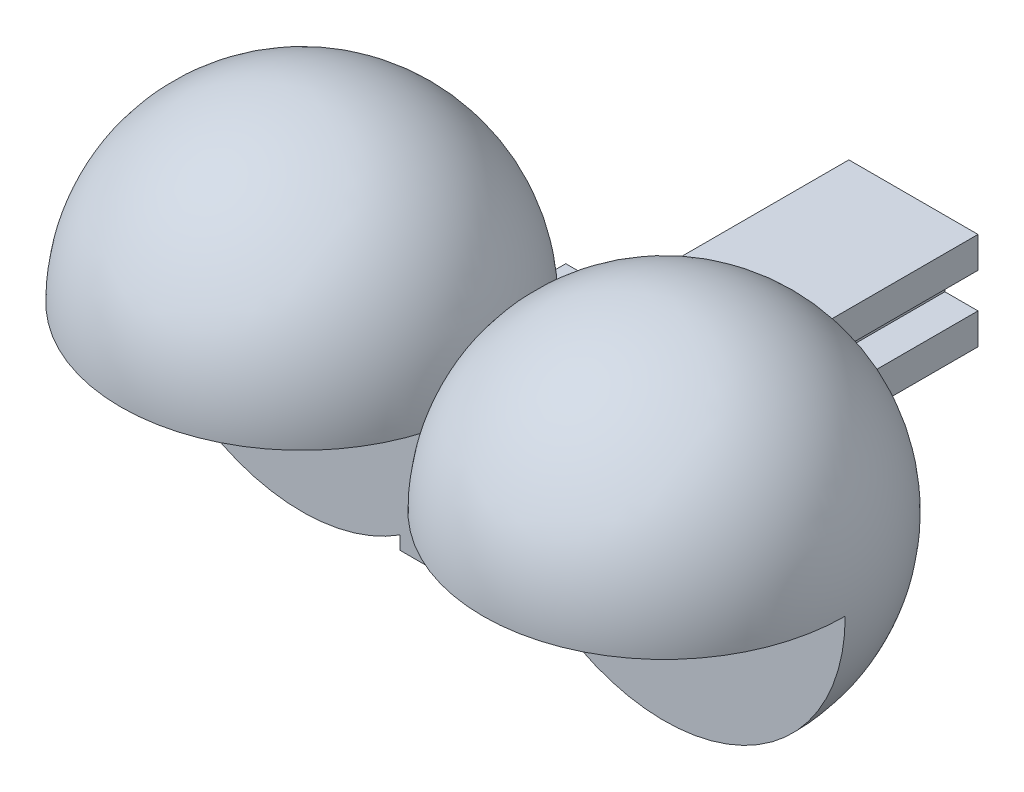
ISO-10303-21;
HEADER;
FILE_DESCRIPTION(('STEP AP214'),'2;1');
FILE_NAME('part.step','',(''),(''),'','','');
FILE_SCHEMA(('AUTOMOTIVE_DESIGN { 1 0 10303 214 1 1 1 1 }'));
ENDSEC;
DATA;
#1=APPLICATION_CONTEXT('core data for automotive mechanical design processes');
#2=APPLICATION_PROTOCOL_DEFINITION('international standard','automotive_design',2000,#1);
#3=PRODUCT_CONTEXT('',#1,'mechanical');
#4=PRODUCT('Part','Part','',(#3));
#5=PRODUCT_RELATED_PRODUCT_CATEGORY('part','',(#4));
#6=PRODUCT_DEFINITION_FORMATION('','',#4);
#7=PRODUCT_DEFINITION_CONTEXT('part definition',#1,'design');
#8=PRODUCT_DEFINITION('design','',#6,#7);
#9=PRODUCT_DEFINITION_SHAPE('','',#8);
#10=(LENGTH_UNIT() NAMED_UNIT(*) SI_UNIT(.MILLI.,.METRE.));
#11=(NAMED_UNIT(*) PLANE_ANGLE_UNIT() SI_UNIT($,.RADIAN.));
#12=(NAMED_UNIT(*) SI_UNIT($,.STERADIAN.) SOLID_ANGLE_UNIT());
#13=UNCERTAINTY_MEASURE_WITH_UNIT(LENGTH_MEASURE(1.E-05),#10,'distance_accuracy_value','');
#14=(GEOMETRIC_REPRESENTATION_CONTEXT(3) GLOBAL_UNCERTAINTY_ASSIGNED_CONTEXT((#13)) GLOBAL_UNIT_ASSIGNED_CONTEXT((#10,
#11,#12)) REPRESENTATION_CONTEXT('',''));
#15=CARTESIAN_POINT('',(0.,0.,0.));
#16=DIRECTION('',(0.,0.,1.));
#17=DIRECTION('',(1.,0.,0.));
#18=AXIS2_PLACEMENT_3D('',#15,#16,#17);
#19=CARTESIAN_POINT('',(-58.0027176246546,-27.35,0.));
#20=DIRECTION('',(0.,0.,-1.));
#21=DIRECTION('',(-1.,0.,0.));
#22=AXIS2_PLACEMENT_3D('',#19,#20,#21);
#23=PLANE('',#22);
#24=DIRECTION('',(0.,-1.,0.));
#25=VECTOR('',#24,1.);
#26=CARTESIAN_POINT('',(12.5,0.,0.));
#27=LINE('',#26,#25);
#28=CARTESIAN_POINT('',(12.5,-22.9673681557117,0.));
#29=VERTEX_POINT('',#28);
#30=CARTESIAN_POINT('',(12.5,-25.,0.));
#31=VERTEX_POINT('',#30);
#32=EDGE_CURVE('E426',#29,#31,#27,.T.);
#33=ORIENTED_EDGE('',*,*,#32,.F.);
#34=CARTESIAN_POINT('',(27.35,0.,0.));
#35=DIRECTION('',(0.,0.,-1.));
#36=DIRECTION('',(-1.,0.,0.));
#37=AXIS2_PLACEMENT_3D('',#34,#35,#36);
#38=CIRCLE('',#37,27.35);
#39=CARTESIAN_POINT('',(54.7,0.,0.));
#40=VERTEX_POINT('',#39);
#41=EDGE_CURVE('E412',#29,#40,#38,.F.);
#42=ORIENTED_EDGE('',*,*,#41,.T.);
#43=DIRECTION('',(-1.,0.,0.));
#44=VECTOR('',#43,1.);
#45=CARTESIAN_POINT('',(-58.0027176246546,0.,0.));
#46=LINE('',#45,#44);
#47=CARTESIAN_POINT('',(42.35,0.,0.));
#48=VERTEX_POINT('',#47);
#49=EDGE_CURVE('E406',#40,#48,#46,.T.);
#50=ORIENTED_EDGE('',*,*,#49,.T.);
#51=CARTESIAN_POINT('',(27.35,0.,0.));
#52=DIRECTION('',(0.,0.,-1.));
#53=DIRECTION('',(-1.,0.,0.));
#54=AXIS2_PLACEMENT_3D('',#51,#52,#53);
#55=CIRCLE('',#54,15.);
#56=CARTESIAN_POINT('',(12.35,0.,0.));
#57=VERTEX_POINT('',#56);
#58=EDGE_CURVE('E403',#48,#57,#55,.T.);
#59=ORIENTED_EDGE('',*,*,#58,.T.);
#60=CARTESIAN_POINT('',(0.,0.,0.));
#61=VERTEX_POINT('',#60);
#62=EDGE_CURVE('E405',#57,#61,#46,.T.);
#63=ORIENTED_EDGE('',*,*,#62,.T.);
#64=DIRECTION('',(-1.,0.,0.));
#65=VECTOR('',#64,1.);
#66=CARTESIAN_POINT('',(-58.0027176246546,0.,0.));
#67=LINE('',#66,#65);
#68=CARTESIAN_POINT('',(-12.35,0.,0.));
#69=VERTEX_POINT('',#68);
#70=EDGE_CURVE('E446',#61,#69,#67,.T.);
#71=ORIENTED_EDGE('',*,*,#70,.T.);
#72=CARTESIAN_POINT('',(-27.35,0.,0.));
#73=DIRECTION('',(0.,0.,-1.));
#74=DIRECTION('',(-1.,0.,0.));
#75=AXIS2_PLACEMENT_3D('',#72,#73,#74);
#76=CIRCLE('',#75,15.);
#77=CARTESIAN_POINT('',(-42.35,0.,0.));
#78=VERTEX_POINT('',#77);
#79=EDGE_CURVE('E443',#78,#69,#76,.F.);
#80=ORIENTED_EDGE('',*,*,#79,.F.);
#81=CARTESIAN_POINT('',(-54.7,0.,0.));
#82=VERTEX_POINT('',#81);
#83=EDGE_CURVE('E445',#78,#82,#67,.T.);
#84=ORIENTED_EDGE('',*,*,#83,.T.);
#85=CARTESIAN_POINT('',(-27.35,0.,0.));
#86=DIRECTION('',(0.,0.,-1.));
#87=DIRECTION('',(-1.,0.,0.));
#88=AXIS2_PLACEMENT_3D('',#85,#86,#87);
#89=CIRCLE('',#88,27.35);
#90=CARTESIAN_POINT('',(-12.5,-22.9673681557117,0.));
#91=VERTEX_POINT('',#90);
#92=EDGE_CURVE('E452',#91,#82,#89,.T.);
#93=ORIENTED_EDGE('',*,*,#92,.F.);
#94=DIRECTION('',(0.,-1.,0.));
#95=VECTOR('',#94,1.);
#96=CARTESIAN_POINT('',(-12.5,0.,0.));
#97=LINE('',#96,#95);
#98=CARTESIAN_POINT('',(-12.5,-25.,0.));
#99=VERTEX_POINT('',#98);
#100=EDGE_CURVE('E423',#91,#99,#97,.T.);
#101=ORIENTED_EDGE('',*,*,#100,.T.);
#102=DIRECTION('',(-1.,0.,0.));
#103=VECTOR('',#102,1.);
#104=CARTESIAN_POINT('',(12.5,-25.,0.));
#105=LINE('',#104,#103);
#106=EDGE_CURVE('E420',#31,#99,#105,.T.);
#107=ORIENTED_EDGE('',*,*,#106,.F.);
#108=EDGE_LOOP('',(#33,#42,#50,#59,#63,#71,#80,#84,#93,#101,#107));
#109=FACE_BOUND('',#108,.T.);
#110=DIRECTION('',(0.,-1.,0.));
#111=VECTOR('',#110,1.);
#112=CARTESIAN_POINT('',(-1.00000000000001,-12.7250256726111,0.));
#113=LINE('',#112,#111);
#114=CARTESIAN_POINT('',(-1.00000000000001,-12.7250256726111,0.));
#115=VERTEX_POINT('',#114);
#116=CARTESIAN_POINT('',(-1.00000000000001,-18.7250256726111,0.));
#117=VERTEX_POINT('',#116);
#118=EDGE_CURVE('E289',#115,#117,#113,.T.);
#119=ORIENTED_EDGE('',*,*,#118,.T.);
#120=DIRECTION('',(1.,0.,0.));
#121=VECTOR('',#120,1.);
#122=CARTESIAN_POINT('',(-7.00000000000001,-18.7250256726111,0.));
#123=LINE('',#122,#121);
#124=CARTESIAN_POINT('',(-7.00000000000001,-18.7250256726111,0.));
#125=VERTEX_POINT('',#124);
#126=EDGE_CURVE('E63',#125,#117,#123,.T.);
#127=ORIENTED_EDGE('',*,*,#126,.F.);
#128=DIRECTION('',(0.,-1.,0.));
#129=VECTOR('',#128,1.);
#130=CARTESIAN_POINT('',(-7.00000000000001,-12.7250256726111,0.));
#131=LINE('',#130,#129);
#132=CARTESIAN_POINT('',(-7.00000000000001,-12.7250256726111,0.));
#133=VERTEX_POINT('',#132);
#134=EDGE_CURVE('E282',#133,#125,#131,.T.);
#135=ORIENTED_EDGE('',*,*,#134,.F.);
#136=DIRECTION('',(1.,0.,0.));
#137=VECTOR('',#136,1.);
#138=CARTESIAN_POINT('',(-7.00000000000001,-12.7250256726111,0.));
#139=LINE('',#138,#137);
#140=EDGE_CURVE('E285',#133,#115,#139,.T.);
#141=ORIENTED_EDGE('',*,*,#140,.T.);
#142=EDGE_LOOP('',(#119,#127,#135,#141));
#143=FACE_BOUND('',#142,.T.);
#144=DIRECTION('',(0.,-1.,0.));
#145=VECTOR('',#144,1.);
#146=CARTESIAN_POINT('',(7.00000000000001,-12.7250256726111,0.));
#147=LINE('',#146,#145);
#148=CARTESIAN_POINT('',(7.00000000000001,-12.7250256726111,0.));
#149=VERTEX_POINT('',#148);
#150=CARTESIAN_POINT('',(7.00000000000001,-18.7250256726111,0.));
#151=VERTEX_POINT('',#150);
#152=EDGE_CURVE('E55',#149,#151,#147,.T.);
#153=ORIENTED_EDGE('',*,*,#152,.T.);
#154=DIRECTION('',(-1.,0.,0.));
#155=VECTOR('',#154,1.);
#156=CARTESIAN_POINT('',(7.00000000000001,-18.7250256726111,0.));
#157=LINE('',#156,#155);
#158=CARTESIAN_POINT('',(1.00000000000001,-18.7250256726111,0.));
#159=VERTEX_POINT('',#158);
#160=EDGE_CURVE('E262',#151,#159,#157,.T.);
#161=ORIENTED_EDGE('',*,*,#160,.T.);
#162=DIRECTION('',(0.,-1.,0.));
#163=VECTOR('',#162,1.);
#164=CARTESIAN_POINT('',(1.00000000000001,-12.7250256726111,0.));
#165=LINE('',#164,#163);
#166=CARTESIAN_POINT('',(1.00000000000001,-12.7250256726111,0.));
#167=VERTEX_POINT('',#166);
#168=EDGE_CURVE('E918',#167,#159,#165,.T.);
#169=ORIENTED_EDGE('',*,*,#168,.F.);
#170=DIRECTION('',(-1.,0.,0.));
#171=VECTOR('',#170,1.);
#172=CARTESIAN_POINT('',(7.00000000000001,-12.7250256726111,0.));
#173=LINE('',#172,#171);
#174=EDGE_CURVE('E249',#149,#167,#173,.T.);
#175=ORIENTED_EDGE('',*,*,#174,.F.);
#176=EDGE_LOOP('',(#153,#161,#169,#175));
#177=FACE_BOUND('',#176,.T.);
#178=ADVANCED_FACE('F40',(#109,#143,#177),#23,.F.);
#179=CARTESIAN_POINT('',(0.,0.,-25.));
#180=DIRECTION('',(0.,0.,-1.));
#181=DIRECTION('',(-1.,0.,0.));
#182=AXIS2_PLACEMENT_3D('',#179,#180,#181);
#183=PLANE('',#182);
#184=DIRECTION('',(0.,1.,0.));
#185=VECTOR('',#184,1.);
#186=CARTESIAN_POINT('',(12.5,0.,-25.));
#187=LINE('',#186,#185);
#188=CARTESIAN_POINT('',(12.5,-25.,-25.));
#189=VERTEX_POINT('',#188);
#190=CARTESIAN_POINT('',(12.5,0.,-25.));
#191=VERTEX_POINT('',#190);
#192=EDGE_CURVE('E391',#189,#191,#187,.T.);
#193=ORIENTED_EDGE('',*,*,#192,.F.);
#194=DIRECTION('',(1.,0.,0.));
#195=VECTOR('',#194,1.);
#196=CARTESIAN_POINT('',(12.5,-25.,-25.));
#197=LINE('',#196,#195);
#198=CARTESIAN_POINT('',(-12.5,-25.,-25.));
#199=VERTEX_POINT('',#198);
#200=EDGE_CURVE('E400',#199,#189,#197,.T.);
#201=ORIENTED_EDGE('',*,*,#200,.F.);
#202=DIRECTION('',(0.,-1.,0.));
#203=VECTOR('',#202,1.);
#204=CARTESIAN_POINT('',(-12.5,0.,-25.));
#205=LINE('',#204,#203);
#206=CARTESIAN_POINT('',(-12.5,0.,-25.));
#207=VERTEX_POINT('',#206);
#208=EDGE_CURVE('E397',#207,#199,#205,.T.);
#209=ORIENTED_EDGE('',*,*,#208,.F.);
#210=DIRECTION('',(-1.,0.,0.));
#211=VECTOR('',#210,1.);
#212=CARTESIAN_POINT('',(12.5,0.,-25.));
#213=LINE('',#212,#211);
#214=EDGE_CURVE('E394',#191,#207,#213,.T.);
#215=ORIENTED_EDGE('',*,*,#214,.F.);
#216=EDGE_LOOP('',(#193,#201,#209,#215));
#217=FACE_BOUND('',#216,.T.);
#218=DIRECTION('',(-1.,0.,0.));
#219=VECTOR('',#218,1.);
#220=CARTESIAN_POINT('',(4.75000000000001,-15.0472275157669,-25.));
#221=LINE('',#220,#219);
#222=CARTESIAN_POINT('',(9.75000000000001,-15.0472275157669,-25.));
#223=VERTEX_POINT('',#222);
#224=CARTESIAN_POINT('',(7.00000000000001,-15.0472275157669,-25.));
#225=VERTEX_POINT('',#224);
#226=EDGE_CURVE('E354',#223,#225,#221,.T.);
#227=ORIENTED_EDGE('',*,*,#226,.T.);
#228=DIRECTION('',(0.,-1.,0.));
#229=VECTOR('',#228,1.);
#230=CARTESIAN_POINT('',(7.00000000000001,-12.7250256726111,-25.));
#231=LINE('',#230,#229);
#232=CARTESIAN_POINT('',(7.00000000000001,-12.7250256726111,-25.));
#233=VERTEX_POINT('',#232);
#234=EDGE_CURVE('E246',#233,#225,#231,.T.);
#235=ORIENTED_EDGE('',*,*,#234,.F.);
#236=DIRECTION('',(-1.,0.,0.));
#237=VECTOR('',#236,1.);
#238=CARTESIAN_POINT('',(7.00000000000001,-12.7250256726111,-25.));
#239=LINE('',#238,#237);
#240=CARTESIAN_POINT('',(4.75000000000001,-12.7250256726111,-25.));
#241=VERTEX_POINT('',#240);
#242=EDGE_CURVE('E512',#233,#241,#239,.T.);
#243=ORIENTED_EDGE('',*,*,#242,.T.);
#244=DIRECTION('',(0.,1.,0.));
#245=VECTOR('',#244,1.);
#246=CARTESIAN_POINT('',(4.75000000000001,-9.74722751576689,-25.));
#247=LINE('',#246,#245);
#248=CARTESIAN_POINT('',(4.75000000000001,-9.74722751576689,-25.));
#249=VERTEX_POINT('',#248);
#250=EDGE_CURVE('E357',#241,#249,#247,.T.);
#251=ORIENTED_EDGE('',*,*,#250,.T.);
#252=DIRECTION('',(1.,0.,0.));
#253=VECTOR('',#252,1.);
#254=CARTESIAN_POINT('',(9.75000000000001,-9.74722751576689,-25.));
#255=LINE('',#254,#253);
#256=CARTESIAN_POINT('',(9.75000000000001,-9.74722751576689,-25.));
#257=VERTEX_POINT('',#256);
#258=EDGE_CURVE('E360',#249,#257,#255,.T.);
#259=ORIENTED_EDGE('',*,*,#258,.T.);
#260=DIRECTION('',(0.,1.,0.));
#261=VECTOR('',#260,1.);
#262=CARTESIAN_POINT('',(9.75000000000001,-5.04722751576689,-25.));
#263=LINE('',#262,#261);
#264=CARTESIAN_POINT('',(9.75000000000001,-5.04722751576689,-25.));
#265=VERTEX_POINT('',#264);
#266=EDGE_CURVE('E362',#257,#265,#263,.T.);
#267=ORIENTED_EDGE('',*,*,#266,.T.);
#268=DIRECTION('',(-1.,0.,0.));
#269=VECTOR('',#268,1.);
#270=CARTESIAN_POINT('',(9.75000000000001,-5.04722751576689,-25.));
#271=LINE('',#270,#269);
#272=CARTESIAN_POINT('',(-9.74999999999999,-5.04722751576689,-25.));
#273=VERTEX_POINT('',#272);
#274=EDGE_CURVE('E365',#265,#273,#271,.T.);
#275=ORIENTED_EDGE('',*,*,#274,.T.);
#276=DIRECTION('',(0.,-1.,0.));
#277=VECTOR('',#276,1.);
#278=CARTESIAN_POINT('',(-9.74999999999999,-5.04722751576689,-25.));
#279=LINE('',#278,#277);
#280=CARTESIAN_POINT('',(-9.74999999999999,-9.74722751576689,-25.));
#281=VERTEX_POINT('',#280);
#282=EDGE_CURVE('E336',#273,#281,#279,.T.);
#283=ORIENTED_EDGE('',*,*,#282,.T.);
#284=DIRECTION('',(1.,0.,0.));
#285=VECTOR('',#284,1.);
#286=CARTESIAN_POINT('',(-9.74999999999999,-9.74722751576689,-25.));
#287=LINE('',#286,#285);
#288=CARTESIAN_POINT('',(-4.74999999999999,-9.74722751576689,-25.));
#289=VERTEX_POINT('',#288);
#290=EDGE_CURVE('E338',#281,#289,#287,.T.);
#291=ORIENTED_EDGE('',*,*,#290,.T.);
#292=DIRECTION('',(0.,-1.,0.));
#293=VECTOR('',#292,1.);
#294=CARTESIAN_POINT('',(-4.74999999999999,-9.74722751576689,-25.));
#295=LINE('',#294,#293);
#296=CARTESIAN_POINT('',(-4.74999999999999,-12.7250256726111,-25.));
#297=VERTEX_POINT('',#296);
#298=EDGE_CURVE('E341',#289,#297,#295,.T.);
#299=ORIENTED_EDGE('',*,*,#298,.T.);
#300=DIRECTION('',(1.,0.,0.));
#301=VECTOR('',#300,1.);
#302=CARTESIAN_POINT('',(-7.00000000000001,-12.7250256726111,-25.));
#303=LINE('',#302,#301);
#304=CARTESIAN_POINT('',(-7.00000000000001,-12.7250256726111,-25.));
#305=VERTEX_POINT('',#304);
#306=EDGE_CURVE('E297',#305,#297,#303,.T.);
#307=ORIENTED_EDGE('',*,*,#306,.F.);
#308=DIRECTION('',(0.,-1.,0.));
#309=VECTOR('',#308,1.);
#310=CARTESIAN_POINT('',(-7.00000000000001,-12.7250256726111,-25.));
#311=LINE('',#310,#309);
#312=CARTESIAN_POINT('',(-7.00000000000001,-15.0472275157669,-25.));
#313=VERTEX_POINT('',#312);
#314=EDGE_CURVE('E293',#305,#313,#311,.T.);
#315=ORIENTED_EDGE('',*,*,#314,.T.);
#316=DIRECTION('',(-1.,0.,0.));
#317=VECTOR('',#316,1.);
#318=CARTESIAN_POINT('',(-4.74999999999999,-15.0472275157669,-25.));
#319=LINE('',#318,#317);
#320=CARTESIAN_POINT('',(-9.74999999999999,-15.0472275157669,-25.));
#321=VERTEX_POINT('',#320);
#322=EDGE_CURVE('E344',#313,#321,#319,.T.);
#323=ORIENTED_EDGE('',*,*,#322,.T.);
#324=DIRECTION('',(0.,-1.,0.));
#325=VECTOR('',#324,1.);
#326=CARTESIAN_POINT('',(-9.74999999999999,-15.0472275157669,-25.));
#327=LINE('',#326,#325);
#328=CARTESIAN_POINT('',(-9.74999999999999,-19.7472275157669,-25.));
#329=VERTEX_POINT('',#328);
#330=EDGE_CURVE('E347',#321,#329,#327,.T.);
#331=ORIENTED_EDGE('',*,*,#330,.T.);
#332=DIRECTION('',(1.,0.,0.));
#333=VECTOR('',#332,1.);
#334=CARTESIAN_POINT('',(-9.74999999999999,-19.7472275157669,-25.));
#335=LINE('',#334,#333);
#336=CARTESIAN_POINT('',(9.75000000000001,-19.7472275157669,-25.));
#337=VERTEX_POINT('',#336);
#338=EDGE_CURVE('E349',#329,#337,#335,.T.);
#339=ORIENTED_EDGE('',*,*,#338,.T.);
#340=DIRECTION('',(0.,1.,0.));
#341=VECTOR('',#340,1.);
#342=CARTESIAN_POINT('',(9.75000000000001,-15.0472275157669,-25.));
#343=LINE('',#342,#341);
#344=EDGE_CURVE('E351',#337,#223,#343,.T.);
#345=ORIENTED_EDGE('',*,*,#344,.T.);
#346=EDGE_LOOP('',(#227,#235,#243,#251,#259,#267,#275,#283,#291,#299,#307,#315,#323,#331,#339,#345));
#347=FACE_BOUND('',#346,.T.);
#348=ADVANCED_FACE('F494',(#217,#347),#183,.T.);
#349=CARTESIAN_POINT('',(12.5,-25.,-40.));
#350=DIRECTION('',(0.,1.,0.));
#351=DIRECTION('',(-1.,0.,0.));
#352=AXIS2_PLACEMENT_3D('',#349,#350,#351);
#353=PLANE('',#352);
#354=ORIENTED_EDGE('',*,*,#200,.T.);
#355=DIRECTION('',(0.,0.,1.));
#356=VECTOR('',#355,1.);
#357=CARTESIAN_POINT('',(12.5,-25.,-40.));
#358=LINE('',#357,#356);
#359=EDGE_CURVE('E429',#189,#31,#358,.T.);
#360=ORIENTED_EDGE('',*,*,#359,.T.);
#361=ORIENTED_EDGE('',*,*,#106,.T.);
#362=DIRECTION('',(0.,0.,1.));
#363=VECTOR('',#362,1.);
#364=CARTESIAN_POINT('',(-12.5,-25.,-40.));
#365=LINE('',#364,#363);
#366=EDGE_CURVE('E435',#199,#99,#365,.T.);
#367=ORIENTED_EDGE('',*,*,#366,.F.);
#368=EDGE_LOOP('',(#354,#360,#361,#367));
#369=FACE_BOUND('',#368,.T.);
#370=ADVANCED_FACE('F489',(#369),#353,.F.);
#371=CARTESIAN_POINT('',(-12.5,0.,-40.));
#372=DIRECTION('',(-1.,0.,0.));
#373=DIRECTION('',(0.,-1.,0.));
#374=AXIS2_PLACEMENT_3D('',#371,#372,#373);
#375=PLANE('',#374);
#376=DIRECTION('',(0.,0.,1.));
#377=VECTOR('',#376,1.);
#378=CARTESIAN_POINT('',(-12.5,0.,-40.));
#379=LINE('',#378,#377);
#380=CARTESIAN_POINT('',(-12.5,0.,-22.9673681557117));
#381=VERTEX_POINT('',#380);
#382=EDGE_CURVE('E433',#207,#381,#379,.T.);
#383=ORIENTED_EDGE('',*,*,#382,.F.);
#384=ORIENTED_EDGE('',*,*,#208,.T.);
#385=ORIENTED_EDGE('',*,*,#366,.T.);
#386=ORIENTED_EDGE('',*,*,#100,.F.);
#387=CARTESIAN_POINT('',(-12.5,0.,0.));
#388=DIRECTION('',(-1.,0.,0.));
#389=DIRECTION('',(0.,-1.,0.));
#390=AXIS2_PLACEMENT_3D('',#387,#388,#389);
#391=CIRCLE('',#390,22.9673681557117);
#392=EDGE_CURVE('E440',#381,#91,#391,.T.);
#393=ORIENTED_EDGE('',*,*,#392,.F.);
#394=EDGE_LOOP('',(#383,#384,#385,#386,#393));
#395=FACE_BOUND('',#394,.T.);
#396=ADVANCED_FACE('F485',(#395),#375,.T.);
#397=CARTESIAN_POINT('',(12.5,0.,-40.));
#398=DIRECTION('',(0.,1.,0.));
#399=DIRECTION('',(-1.,0.,0.));
#400=AXIS2_PLACEMENT_3D('',#397,#398,#399);
#401=PLANE('',#400);
#402=DIRECTION('',(0.,0.,1.));
#403=VECTOR('',#402,1.);
#404=CARTESIAN_POINT('',(12.5,0.,-40.));
#405=LINE('',#404,#403);
#406=CARTESIAN_POINT('',(12.5,0.,-22.9673681557117));
#407=VERTEX_POINT('',#406);
#408=EDGE_CURVE('E431',#191,#407,#405,.T.);
#409=ORIENTED_EDGE('',*,*,#408,.F.);
#410=ORIENTED_EDGE('',*,*,#214,.T.);
#411=ORIENTED_EDGE('',*,*,#382,.T.);
#412=CARTESIAN_POINT('',(-27.35,0.,0.));
#413=DIRECTION('',(0.,1.,0.));
#414=DIRECTION('',(-1.,0.,0.));
#415=AXIS2_PLACEMENT_3D('',#412,#413,#414);
#416=CIRCLE('',#415,27.35);
#417=EDGE_CURVE('E437',#61,#381,#416,.T.);
#418=ORIENTED_EDGE('',*,*,#417,.F.);
#419=CARTESIAN_POINT('',(27.35,0.,0.));
#420=DIRECTION('',(0.,1.,0.));
#421=DIRECTION('',(-1.,0.,0.));
#422=AXIS2_PLACEMENT_3D('',#419,#420,#421);
#423=CIRCLE('',#422,27.35);
#424=EDGE_CURVE('E417',#407,#61,#423,.T.);
#425=ORIENTED_EDGE('',*,*,#424,.F.);
#426=EDGE_LOOP('',(#409,#410,#411,#418,#425));
#427=FACE_BOUND('',#426,.T.);
#428=ADVANCED_FACE('F479',(#427),#401,.T.);
#429=CARTESIAN_POINT('',(12.5,0.,-40.));
#430=DIRECTION('',(-1.,0.,0.));
#431=DIRECTION('',(0.,-1.,0.));
#432=AXIS2_PLACEMENT_3D('',#429,#430,#431);
#433=PLANE('',#432);
#434=ORIENTED_EDGE('',*,*,#192,.T.);
#435=ORIENTED_EDGE('',*,*,#408,.T.);
#436=CARTESIAN_POINT('',(12.5,0.,0.));
#437=DIRECTION('',(-1.,0.,0.));
#438=DIRECTION('',(0.,-1.,0.));
#439=AXIS2_PLACEMENT_3D('',#436,#437,#438);
#440=CIRCLE('',#439,22.9673681557117);
#441=EDGE_CURVE('E11',#407,#29,#440,.T.);
#442=ORIENTED_EDGE('',*,*,#441,.T.);
#443=ORIENTED_EDGE('',*,*,#32,.T.);
#444=ORIENTED_EDGE('',*,*,#359,.F.);
#445=EDGE_LOOP('',(#434,#435,#442,#443,#444));
#446=FACE_BOUND('',#445,.T.);
#447=ADVANCED_FACE('F492',(#446),#433,.F.);
#448=CARTESIAN_POINT('',(-27.35,0.,0.));
#449=DIRECTION('',(-1.,0.,0.));
#450=DIRECTION('',(0.,1.,0.));
#451=AXIS2_PLACEMENT_3D('',#448,#449,#450);
#452=SPHERICAL_SURFACE('',#451,27.35);
#453=ORIENTED_EDGE('',*,*,#417,.T.);
#454=ORIENTED_EDGE('',*,*,#392,.T.);
#455=ORIENTED_EDGE('',*,*,#92,.T.);
#456=CARTESIAN_POINT('',(-27.35,0.,0.));
#457=DIRECTION('',(0.,1.,0.));
#458=DIRECTION('',(0.,0.,1.));
#459=AXIS2_PLACEMENT_3D('',#456,#457,#458);
#460=CIRCLE('',#459,27.35);
#461=EDGE_CURVE('E449',#82,#61,#460,.T.);
#462=ORIENTED_EDGE('',*,*,#461,.T.);
#463=EDGE_LOOP('',(#453,#454,#455,#462));
#464=FACE_BOUND('',#463,.T.);
#465=ADVANCED_FACE('F42',(#464),#452,.T.);
#466=CARTESIAN_POINT('',(0.,0.,0.));
#467=DIRECTION('',(0.,1.,0.));
#468=DIRECTION('',(0.,0.,1.));
#469=AXIS2_PLACEMENT_3D('',#466,#467,#468);
#470=PLANE('',#469);
#471=CARTESIAN_POINT('',(-27.35,0.,0.));
#472=DIRECTION('',(0.,1.,0.));
#473=DIRECTION('',(0.,0.,1.));
#474=AXIS2_PLACEMENT_3D('',#471,#472,#473);
#475=CIRCLE('',#474,15.);
#476=EDGE_CURVE('E48',#69,#78,#475,.F.);
#477=ORIENTED_EDGE('',*,*,#476,.F.);
#478=ORIENTED_EDGE('',*,*,#70,.F.);
#479=ORIENTED_EDGE('',*,*,#461,.F.);
#480=ORIENTED_EDGE('',*,*,#83,.F.);
#481=EDGE_LOOP('',(#477,#478,#479,#480));
#482=FACE_BOUND('',#481,.T.);
#483=ADVANCED_FACE('F460',(#482),#470,.F.);
#484=CARTESIAN_POINT('',(-27.35,0.,0.));
#485=DIRECTION('',(-1.,0.,0.));
#486=DIRECTION('',(0.,1.,0.));
#487=AXIS2_PLACEMENT_3D('',#484,#485,#486);
#488=SPHERICAL_SURFACE('',#487,15.);
#489=ORIENTED_EDGE('',*,*,#476,.T.);
#490=ORIENTED_EDGE('',*,*,#79,.T.);
#491=EDGE_LOOP('',(#489,#490));
#492=FACE_BOUND('',#491,.T.);
#493=ADVANCED_FACE('F456',(#492),#488,.T.);
#494=CARTESIAN_POINT('',(27.35,0.,0.));
#495=DIRECTION('',(-1.,0.,0.));
#496=DIRECTION('',(0.,1.,0.));
#497=AXIS2_PLACEMENT_3D('',#494,#495,#496);
#498=SPHERICAL_SURFACE('',#497,27.35);
#499=ORIENTED_EDGE('',*,*,#441,.F.);
#500=ORIENTED_EDGE('',*,*,#424,.T.);
#501=CARTESIAN_POINT('',(27.35,0.,0.));
#502=DIRECTION('',(0.,1.,0.));
#503=DIRECTION('',(0.,0.,1.));
#504=AXIS2_PLACEMENT_3D('',#501,#502,#503);
#505=CIRCLE('',#504,27.35);
#506=EDGE_CURVE('E409',#40,#61,#505,.F.);
#507=ORIENTED_EDGE('',*,*,#506,.F.);
#508=ORIENTED_EDGE('',*,*,#41,.F.);
#509=EDGE_LOOP('',(#499,#500,#507,#508));
#510=FACE_BOUND('',#509,.T.);
#511=ADVANCED_FACE('F474',(#510),#498,.T.);
#512=CARTESIAN_POINT('',(0.,0.,0.));
#513=DIRECTION('',(0.,1.,0.));
#514=DIRECTION('',(0.,0.,1.));
#515=AXIS2_PLACEMENT_3D('',#512,#513,#514);
#516=PLANE('',#515);
#517=ORIENTED_EDGE('',*,*,#62,.F.);
#518=CARTESIAN_POINT('',(27.35,0.,0.));
#519=DIRECTION('',(0.,1.,0.));
#520=DIRECTION('',(0.,0.,1.));
#521=AXIS2_PLACEMENT_3D('',#518,#519,#520);
#522=CIRCLE('',#521,15.);
#523=EDGE_CURVE('E414',#57,#48,#522,.T.);
#524=ORIENTED_EDGE('',*,*,#523,.T.);
#525=ORIENTED_EDGE('',*,*,#49,.F.);
#526=ORIENTED_EDGE('',*,*,#506,.T.);
#527=EDGE_LOOP('',(#517,#524,#525,#526));
#528=FACE_BOUND('',#527,.T.);
#529=ADVANCED_FACE('F468',(#528),#516,.F.);
#530=CARTESIAN_POINT('',(27.35,0.,0.));
#531=DIRECTION('',(-1.,0.,0.));
#532=DIRECTION('',(0.,1.,0.));
#533=AXIS2_PLACEMENT_3D('',#530,#531,#532);
#534=SPHERICAL_SURFACE('',#533,15.);
#535=ORIENTED_EDGE('',*,*,#58,.F.);
#536=ORIENTED_EDGE('',*,*,#523,.F.);
#537=EDGE_LOOP('',(#535,#536));
#538=FACE_BOUND('',#537,.T.);
#539=ADVANCED_FACE('F610',(#538),#534,.T.);
#540=CARTESIAN_POINT('',(-9.74999999999999,-5.04722751576689,-25.));
#541=DIRECTION('',(1.,0.,0.));
#542=DIRECTION('',(0.,1.,0.));
#543=AXIS2_PLACEMENT_3D('',#540,#541,#542);
#544=PLANE('',#543);
#545=DIRECTION('',(0.,0.,-1.));
#546=VECTOR('',#545,1.);
#547=CARTESIAN_POINT('',(-9.74999999999999,-9.74722751576689,-25.));
#548=LINE('',#547,#546);
#549=CARTESIAN_POINT('',(-9.74999999999999,-9.74722751576689,-65.));
#550=VERTEX_POINT('',#549);
#551=EDGE_CURVE('E389',#281,#550,#548,.T.);
#552=ORIENTED_EDGE('',*,*,#551,.F.);
#553=ORIENTED_EDGE('',*,*,#282,.F.);
#554=DIRECTION('',(0.,0.,-1.));
#555=VECTOR('',#554,1.);
#556=CARTESIAN_POINT('',(-9.74999999999999,-5.04722751576689,-25.));
#557=LINE('',#556,#555);
#558=CARTESIAN_POINT('',(-9.74999999999999,-5.04722751576689,-65.));
#559=VERTEX_POINT('',#558);
#560=EDGE_CURVE('E367',#273,#559,#557,.T.);
#561=ORIENTED_EDGE('',*,*,#560,.T.);
#562=DIRECTION('',(0.,1.,0.));
#563=VECTOR('',#562,1.);
#564=CARTESIAN_POINT('',(-9.74999999999999,-9.74722751576689,-65.));
#565=LINE('',#564,#563);
#566=EDGE_CURVE('E263',#550,#559,#565,.T.);
#567=ORIENTED_EDGE('',*,*,#566,.F.);
#568=EDGE_LOOP('',(#552,#553,#561,#567));
#569=FACE_BOUND('',#568,.T.);
#570=ADVANCED_FACE('F535',(#569),#544,.F.);
#571=CARTESIAN_POINT('',(-9.74999999999999,-9.74722751576689,-25.));
#572=DIRECTION('',(0.,1.,0.));
#573=DIRECTION('',(0.,0.,1.));
#574=AXIS2_PLACEMENT_3D('',#571,#572,#573);
#575=PLANE('',#574);
#576=DIRECTION('',(0.,0.,-1.));
#577=VECTOR('',#576,1.);
#578=CARTESIAN_POINT('',(-4.74999999999999,-9.74722751576689,-25.));
#579=LINE('',#578,#577);
#580=CARTESIAN_POINT('',(-4.74999999999999,-9.74722751576689,-65.));
#581=VERTEX_POINT('',#580);
#582=EDGE_CURVE('E387',#289,#581,#579,.T.);
#583=ORIENTED_EDGE('',*,*,#582,.F.);
#584=ORIENTED_EDGE('',*,*,#290,.F.);
#585=ORIENTED_EDGE('',*,*,#551,.T.);
#586=DIRECTION('',(-1.,0.,0.));
#587=VECTOR('',#586,1.);
#588=CARTESIAN_POINT('',(-4.74999999999999,-9.74722751576689,-65.));
#589=LINE('',#588,#587);
#590=EDGE_CURVE('E333',#581,#550,#589,.T.);
#591=ORIENTED_EDGE('',*,*,#590,.F.);
#592=EDGE_LOOP('',(#583,#584,#585,#591));
#593=FACE_BOUND('',#592,.T.);
#594=ADVANCED_FACE('F542',(#593),#575,.F.);
#595=CARTESIAN_POINT('',(-4.74999999999999,-9.74722751576689,-25.));
#596=DIRECTION('',(1.,0.,0.));
#597=DIRECTION('',(0.,0.,-1.));
#598=AXIS2_PLACEMENT_3D('',#595,#596,#597);
#599=PLANE('',#598);
#600=DIRECTION('',(0.,0.,-1.));
#601=VECTOR('',#600,1.);
#602=CARTESIAN_POINT('',(-4.74999999999999,-15.0472275157669,-25.));
#603=LINE('',#602,#601);
#604=CARTESIAN_POINT('',(-4.74999999999999,-15.0472275157669,-25.));
#605=VERTEX_POINT('',#604);
#606=CARTESIAN_POINT('',(-4.74999999999999,-15.0472275157669,-65.));
#607=VERTEX_POINT('',#606);
#608=EDGE_CURVE('E385',#605,#607,#603,.T.);
#609=ORIENTED_EDGE('',*,*,#608,.F.);
#610=EDGE_CURVE('E340',#297,#605,#295,.T.);
#611=ORIENTED_EDGE('',*,*,#610,.F.);
#612=ORIENTED_EDGE('',*,*,#298,.F.);
#613=ORIENTED_EDGE('',*,*,#582,.T.);
#614=DIRECTION('',(0.,1.,0.));
#615=VECTOR('',#614,1.);
#616=CARTESIAN_POINT('',(-4.74999999999999,-15.0472275157669,-65.));
#617=LINE('',#616,#615);
#618=EDGE_CURVE('E330',#607,#581,#617,.T.);
#619=ORIENTED_EDGE('',*,*,#618,.F.);
#620=EDGE_LOOP('',(#609,#611,#612,#613,#619));
#621=FACE_BOUND('',#620,.T.);
#622=ADVANCED_FACE('F547',(#621),#599,.F.);
#623=CARTESIAN_POINT('',(-4.74999999999999,-15.0472275157669,-25.));
#624=DIRECTION('',(0.,-1.,0.));
#625=DIRECTION('',(0.,0.,-1.));
#626=AXIS2_PLACEMENT_3D('',#623,#624,#625);
#627=PLANE('',#626);
#628=DIRECTION('',(0.,0.,-1.));
#629=VECTOR('',#628,1.);
#630=CARTESIAN_POINT('',(-9.74999999999999,-15.0472275157669,-25.));
#631=LINE('',#630,#629);
#632=CARTESIAN_POINT('',(-9.74999999999999,-15.0472275157669,-65.));
#633=VERTEX_POINT('',#632);
#634=EDGE_CURVE('E383',#321,#633,#631,.T.);
#635=ORIENTED_EDGE('',*,*,#634,.F.);
#636=ORIENTED_EDGE('',*,*,#322,.F.);
#637=EDGE_CURVE('E345',#605,#313,#319,.T.);
#638=ORIENTED_EDGE('',*,*,#637,.F.);
#639=ORIENTED_EDGE('',*,*,#608,.T.);
#640=DIRECTION('',(1.,0.,0.));
#641=VECTOR('',#640,1.);
#642=CARTESIAN_POINT('',(-9.74999999999999,-15.0472275157669,-65.));
#643=LINE('',#642,#641);
#644=EDGE_CURVE('E327',#633,#607,#643,.T.);
#645=ORIENTED_EDGE('',*,*,#644,.F.);
#646=EDGE_LOOP('',(#635,#636,#638,#639,#645));
#647=FACE_BOUND('',#646,.T.);
#648=ADVANCED_FACE('F562',(#647),#627,.F.);
#649=CARTESIAN_POINT('',(-9.74999999999999,-15.0472275157669,-25.));
#650=DIRECTION('',(1.,0.,0.));
#651=DIRECTION('',(0.,1.,0.));
#652=AXIS2_PLACEMENT_3D('',#649,#650,#651);
#653=PLANE('',#652);
#654=DIRECTION('',(0.,0.,-1.));
#655=VECTOR('',#654,1.);
#656=CARTESIAN_POINT('',(-9.74999999999999,-19.7472275157669,-25.));
#657=LINE('',#656,#655);
#658=CARTESIAN_POINT('',(-9.74999999999999,-19.7472275157669,-65.));
#659=VERTEX_POINT('',#658);
#660=EDGE_CURVE('E381',#329,#659,#657,.T.);
#661=ORIENTED_EDGE('',*,*,#660,.F.);
#662=ORIENTED_EDGE('',*,*,#330,.F.);
#663=ORIENTED_EDGE('',*,*,#634,.T.);
#664=DIRECTION('',(0.,1.,0.));
#665=VECTOR('',#664,1.);
#666=CARTESIAN_POINT('',(-9.74999999999999,-19.7472275157669,-65.));
#667=LINE('',#666,#665);
#668=EDGE_CURVE('E324',#659,#633,#667,.T.);
#669=ORIENTED_EDGE('',*,*,#668,.F.);
#670=EDGE_LOOP('',(#661,#662,#663,#669));
#671=FACE_BOUND('',#670,.T.);
#672=ADVANCED_FACE('F568',(#671),#653,.F.);
#673=CARTESIAN_POINT('',(-9.74999999999999,-19.7472275157669,-25.));
#674=DIRECTION('',(0.,1.,0.));
#675=DIRECTION('',(-1.,0.,0.));
#676=AXIS2_PLACEMENT_3D('',#673,#674,#675);
#677=PLANE('',#676);
#678=DIRECTION('',(0.,0.,-1.));
#679=VECTOR('',#678,1.);
#680=CARTESIAN_POINT('',(9.75000000000001,-19.7472275157669,-25.));
#681=LINE('',#680,#679);
#682=CARTESIAN_POINT('',(9.75000000000001,-19.7472275157669,-65.));
#683=VERTEX_POINT('',#682);
#684=EDGE_CURVE('E379',#337,#683,#681,.T.);
#685=ORIENTED_EDGE('',*,*,#684,.F.);
#686=ORIENTED_EDGE('',*,*,#338,.F.);
#687=ORIENTED_EDGE('',*,*,#660,.T.);
#688=DIRECTION('',(-1.,0.,0.));
#689=VECTOR('',#688,1.);
#690=CARTESIAN_POINT('',(9.75000000000001,-19.7472275157669,-65.));
#691=LINE('',#690,#689);
#692=EDGE_CURVE('E321',#683,#659,#691,.T.);
#693=ORIENTED_EDGE('',*,*,#692,.F.);
#694=EDGE_LOOP('',(#685,#686,#687,#693));
#695=FACE_BOUND('',#694,.T.);
#696=ADVANCED_FACE('F573',(#695),#677,.F.);
#697=CARTESIAN_POINT('',(9.75000000000001,-15.0472275157669,-25.));
#698=DIRECTION('',(-1.,0.,0.));
#699=DIRECTION('',(0.,-1.,0.));
#700=AXIS2_PLACEMENT_3D('',#697,#698,#699);
#701=PLANE('',#700);
#702=DIRECTION('',(0.,0.,-1.));
#703=VECTOR('',#702,1.);
#704=CARTESIAN_POINT('',(9.75000000000001,-15.0472275157669,-25.));
#705=LINE('',#704,#703);
#706=CARTESIAN_POINT('',(9.75000000000001,-15.0472275157669,-65.));
#707=VERTEX_POINT('',#706);
#708=EDGE_CURVE('E377',#223,#707,#705,.T.);
#709=ORIENTED_EDGE('',*,*,#708,.F.);
#710=ORIENTED_EDGE('',*,*,#344,.F.);
#711=ORIENTED_EDGE('',*,*,#684,.T.);
#712=DIRECTION('',(0.,-1.,0.));
#713=VECTOR('',#712,1.);
#714=CARTESIAN_POINT('',(9.75000000000001,-15.0472275157669,-65.));
#715=LINE('',#714,#713);
#716=EDGE_CURVE('E318',#707,#683,#715,.T.);
#717=ORIENTED_EDGE('',*,*,#716,.F.);
#718=EDGE_LOOP('',(#709,#710,#711,#717));
#719=FACE_BOUND('',#718,.T.);
#720=ADVANCED_FACE('F576',(#719),#701,.F.);
#721=CARTESIAN_POINT('',(4.75000000000001,-15.0472275157669,-25.));
#722=DIRECTION('',(0.,-1.,0.));
#723=DIRECTION('',(0.,0.,-1.));
#724=AXIS2_PLACEMENT_3D('',#721,#722,#723);
#725=PLANE('',#724);
#726=DIRECTION('',(0.,0.,-1.));
#727=VECTOR('',#726,1.);
#728=CARTESIAN_POINT('',(4.75000000000001,-15.0472275157669,-25.));
#729=LINE('',#728,#727);
#730=CARTESIAN_POINT('',(4.75000000000001,-15.0472275157669,-25.));
#731=VERTEX_POINT('',#730);
#732=CARTESIAN_POINT('',(4.75000000000001,-15.0472275157669,-65.));
#733=VERTEX_POINT('',#732);
#734=EDGE_CURVE('E375',#731,#733,#729,.T.);
#735=ORIENTED_EDGE('',*,*,#734,.F.);
#736=EDGE_CURVE('E353',#225,#731,#221,.T.);
#737=ORIENTED_EDGE('',*,*,#736,.F.);
#738=ORIENTED_EDGE('',*,*,#226,.F.);
#739=ORIENTED_EDGE('',*,*,#708,.T.);
#740=DIRECTION('',(1.,0.,0.));
#741=VECTOR('',#740,1.);
#742=CARTESIAN_POINT('',(4.75000000000001,-15.0472275157669,-65.));
#743=LINE('',#742,#741);
#744=EDGE_CURVE('E315',#733,#707,#743,.T.);
#745=ORIENTED_EDGE('',*,*,#744,.F.);
#746=EDGE_LOOP('',(#735,#737,#738,#739,#745));
#747=FACE_BOUND('',#746,.T.);
#748=ADVANCED_FACE('F504',(#747),#725,.F.);
#749=CARTESIAN_POINT('',(4.75000000000001,-9.74722751576689,-25.));
#750=DIRECTION('',(-1.,0.,0.));
#751=DIRECTION('',(0.,-1.,0.));
#752=AXIS2_PLACEMENT_3D('',#749,#750,#751);
#753=PLANE('',#752);
#754=DIRECTION('',(0.,0.,-1.));
#755=VECTOR('',#754,1.);
#756=CARTESIAN_POINT('',(4.75000000000001,-9.74722751576689,-25.));
#757=LINE('',#756,#755);
#758=CARTESIAN_POINT('',(4.75000000000001,-9.74722751576689,-65.));
#759=VERTEX_POINT('',#758);
#760=EDGE_CURVE('E373',#249,#759,#757,.T.);
#761=ORIENTED_EDGE('',*,*,#760,.F.);
#762=ORIENTED_EDGE('',*,*,#250,.F.);
#763=EDGE_CURVE('E358',#731,#241,#247,.T.);
#764=ORIENTED_EDGE('',*,*,#763,.F.);
#765=ORIENTED_EDGE('',*,*,#734,.T.);
#766=DIRECTION('',(0.,-1.,0.));
#767=VECTOR('',#766,1.);
#768=CARTESIAN_POINT('',(4.75000000000001,-9.74722751576689,-65.));
#769=LINE('',#768,#767);
#770=EDGE_CURVE('E312',#759,#733,#769,.T.);
#771=ORIENTED_EDGE('',*,*,#770,.F.);
#772=EDGE_LOOP('',(#761,#762,#764,#765,#771));
#773=FACE_BOUND('',#772,.T.);
#774=ADVANCED_FACE('F517',(#773),#753,.F.);
#775=CARTESIAN_POINT('',(9.75000000000001,-9.74722751576689,-25.));
#776=DIRECTION('',(0.,1.,0.));
#777=DIRECTION('',(0.,0.,1.));
#778=AXIS2_PLACEMENT_3D('',#775,#776,#777);
#779=PLANE('',#778);
#780=DIRECTION('',(0.,0.,-1.));
#781=VECTOR('',#780,1.);
#782=CARTESIAN_POINT('',(9.75000000000001,-9.74722751576689,-25.));
#783=LINE('',#782,#781);
#784=CARTESIAN_POINT('',(9.75000000000001,-9.74722751576689,-65.));
#785=VERTEX_POINT('',#784);
#786=EDGE_CURVE('E371',#257,#785,#783,.T.);
#787=ORIENTED_EDGE('',*,*,#786,.F.);
#788=ORIENTED_EDGE('',*,*,#258,.F.);
#789=ORIENTED_EDGE('',*,*,#760,.T.);
#790=DIRECTION('',(-1.,0.,0.));
#791=VECTOR('',#790,1.);
#792=CARTESIAN_POINT('',(9.75000000000001,-9.74722751576689,-65.));
#793=LINE('',#792,#791);
#794=EDGE_CURVE('E309',#785,#759,#793,.T.);
#795=ORIENTED_EDGE('',*,*,#794,.F.);
#796=EDGE_LOOP('',(#787,#788,#789,#795));
#797=FACE_BOUND('',#796,.T.);
#798=ADVANCED_FACE('F523',(#797),#779,.F.);
#799=CARTESIAN_POINT('',(9.75000000000001,-5.04722751576689,-25.));
#800=DIRECTION('',(-1.,0.,0.));
#801=DIRECTION('',(0.,-1.,0.));
#802=AXIS2_PLACEMENT_3D('',#799,#800,#801);
#803=PLANE('',#802);
#804=DIRECTION('',(0.,0.,-1.));
#805=VECTOR('',#804,1.);
#806=CARTESIAN_POINT('',(9.75000000000001,-5.04722751576689,-25.));
#807=LINE('',#806,#805);
#808=CARTESIAN_POINT('',(9.75000000000001,-5.04722751576689,-65.));
#809=VERTEX_POINT('',#808);
#810=EDGE_CURVE('E369',#265,#809,#807,.T.);
#811=ORIENTED_EDGE('',*,*,#810,.F.);
#812=ORIENTED_EDGE('',*,*,#266,.F.);
#813=ORIENTED_EDGE('',*,*,#786,.T.);
#814=DIRECTION('',(0.,-1.,0.));
#815=VECTOR('',#814,1.);
#816=CARTESIAN_POINT('',(9.75000000000001,-5.04722751576689,-65.));
#817=LINE('',#816,#815);
#818=EDGE_CURVE('E306',#809,#785,#817,.T.);
#819=ORIENTED_EDGE('',*,*,#818,.F.);
#820=EDGE_LOOP('',(#811,#812,#813,#819));
#821=FACE_BOUND('',#820,.T.);
#822=ADVANCED_FACE('F580',(#821),#803,.F.);
#823=CARTESIAN_POINT('',(9.75000000000001,-5.04722751576689,-25.));
#824=DIRECTION('',(0.,-1.,0.));
#825=DIRECTION('',(1.,0.,0.));
#826=AXIS2_PLACEMENT_3D('',#823,#824,#825);
#827=PLANE('',#826);
#828=ORIENTED_EDGE('',*,*,#560,.F.);
#829=ORIENTED_EDGE('',*,*,#274,.F.);
#830=ORIENTED_EDGE('',*,*,#810,.T.);
#831=DIRECTION('',(1.,0.,0.));
#832=VECTOR('',#831,1.);
#833=CARTESIAN_POINT('',(-9.74999999999999,-5.04722751576689,-65.));
#834=LINE('',#833,#832);
#835=EDGE_CURVE('E267',#559,#809,#834,.T.);
#836=ORIENTED_EDGE('',*,*,#835,.F.);
#837=EDGE_LOOP('',(#828,#829,#830,#836));
#838=FACE_BOUND('',#837,.T.);
#839=ADVANCED_FACE('F529',(#838),#827,.F.);
#840=CARTESIAN_POINT('',(0.,0.,-65.));
#841=DIRECTION('',(0.,0.,-1.));
#842=DIRECTION('',(-1.,0.,0.));
#843=AXIS2_PLACEMENT_3D('',#840,#841,#842);
#844=PLANE('',#843);
#845=ORIENTED_EDGE('',*,*,#566,.T.);
#846=ORIENTED_EDGE('',*,*,#835,.T.);
#847=ORIENTED_EDGE('',*,*,#818,.T.);
#848=ORIENTED_EDGE('',*,*,#794,.T.);
#849=ORIENTED_EDGE('',*,*,#770,.T.);
#850=ORIENTED_EDGE('',*,*,#744,.T.);
#851=ORIENTED_EDGE('',*,*,#716,.T.);
#852=ORIENTED_EDGE('',*,*,#692,.T.);
#853=ORIENTED_EDGE('',*,*,#668,.T.);
#854=ORIENTED_EDGE('',*,*,#644,.T.);
#855=ORIENTED_EDGE('',*,*,#618,.T.);
#856=ORIENTED_EDGE('',*,*,#590,.T.);
#857=EDGE_LOOP('',(#845,#846,#847,#848,#849,#850,#851,#852,#853,#854,#855,#856));
#858=FACE_BOUND('',#857,.T.);
#859=ADVANCED_FACE('F578',(#858),#844,.T.);
#860=CARTESIAN_POINT('',(0.,0.,-25.));
#861=DIRECTION('',(0.,0.,-1.));
#862=DIRECTION('',(-1.,0.,0.));
#863=AXIS2_PLACEMENT_3D('',#860,#861,#862);
#864=PLANE('',#863);
#865=ORIENTED_EDGE('',*,*,#637,.T.);
#866=CARTESIAN_POINT('',(-7.00000000000001,-18.7250256726111,-25.));
#867=VERTEX_POINT('',#866);
#868=EDGE_CURVE('E275',#313,#867,#311,.T.);
#869=ORIENTED_EDGE('',*,*,#868,.T.);
#870=DIRECTION('',(1.,0.,0.));
#871=VECTOR('',#870,1.);
#872=CARTESIAN_POINT('',(-7.00000000000001,-18.7250256726111,-25.));
#873=LINE('',#872,#871);
#874=CARTESIAN_POINT('',(-1.00000000000001,-18.7250256726111,-25.));
#875=VERTEX_POINT('',#874);
#876=EDGE_CURVE('E286',#867,#875,#873,.T.);
#877=ORIENTED_EDGE('',*,*,#876,.T.);
#878=DIRECTION('',(0.,-1.,0.));
#879=VECTOR('',#878,1.);
#880=CARTESIAN_POINT('',(-1.00000000000001,-12.7250256726111,-25.));
#881=LINE('',#880,#879);
#882=CARTESIAN_POINT('',(-1.00000000000001,-12.7250256726111,-25.));
#883=VERTEX_POINT('',#882);
#884=EDGE_CURVE('E300',#883,#875,#881,.T.);
#885=ORIENTED_EDGE('',*,*,#884,.F.);
#886=EDGE_CURVE('E296',#297,#883,#303,.T.);
#887=ORIENTED_EDGE('',*,*,#886,.F.);
#888=ORIENTED_EDGE('',*,*,#610,.T.);
#889=EDGE_LOOP('',(#865,#869,#877,#885,#887,#888));
#890=FACE_BOUND('',#889,.T.);
#891=ADVANCED_FACE('F550',(#890),#864,.F.);
#892=CARTESIAN_POINT('',(-7.00000000000001,-18.7250256726111,-25.));
#893=DIRECTION('',(0.,-1.,0.));
#894=DIRECTION('',(0.,0.,-1.));
#895=AXIS2_PLACEMENT_3D('',#892,#893,#894);
#896=PLANE('',#895);
#897=ORIENTED_EDGE('',*,*,#126,.T.);
#898=DIRECTION('',(0.,0.,1.));
#899=VECTOR('',#898,1.);
#900=CARTESIAN_POINT('',(-1.00000000000001,-18.7250256726111,-25.));
#901=LINE('',#900,#899);
#902=EDGE_CURVE('E273',#875,#117,#901,.T.);
#903=ORIENTED_EDGE('',*,*,#902,.F.);
#904=ORIENTED_EDGE('',*,*,#876,.F.);
#905=DIRECTION('',(0.,0.,1.));
#906=VECTOR('',#905,1.);
#907=CARTESIAN_POINT('',(-7.00000000000001,-18.7250256726111,-25.));
#908=LINE('',#907,#906);
#909=EDGE_CURVE('E280',#867,#125,#908,.T.);
#910=ORIENTED_EDGE('',*,*,#909,.T.);
#911=EDGE_LOOP('',(#897,#903,#904,#910));
#912=FACE_BOUND('',#911,.T.);
#913=ADVANCED_FACE('F642',(#912),#896,.F.);
#914=CARTESIAN_POINT('',(-7.00000000000001,-12.7250256726111,-25.));
#915=DIRECTION('',(-1.,0.,0.));
#916=DIRECTION('',(0.,-1.,0.));
#917=AXIS2_PLACEMENT_3D('',#914,#915,#916);
#918=PLANE('',#917);
#919=ORIENTED_EDGE('',*,*,#134,.T.);
#920=ORIENTED_EDGE('',*,*,#909,.F.);
#921=ORIENTED_EDGE('',*,*,#868,.F.);
#922=ORIENTED_EDGE('',*,*,#314,.F.);
#923=DIRECTION('',(0.,0.,1.));
#924=VECTOR('',#923,1.);
#925=CARTESIAN_POINT('',(-7.00000000000001,-12.7250256726111,-25.));
#926=LINE('',#925,#924);
#927=EDGE_CURVE('E278',#305,#133,#926,.T.);
#928=ORIENTED_EDGE('',*,*,#927,.T.);
#929=EDGE_LOOP('',(#919,#920,#921,#922,#928));
#930=FACE_BOUND('',#929,.T.);
#931=ADVANCED_FACE('F652',(#930),#918,.F.);
#932=CARTESIAN_POINT('',(-7.00000000000001,-12.7250256726111,-25.));
#933=DIRECTION('',(0.,-1.,0.));
#934=DIRECTION('',(0.,0.,-1.));
#935=AXIS2_PLACEMENT_3D('',#932,#933,#934);
#936=PLANE('',#935);
#937=ORIENTED_EDGE('',*,*,#140,.F.);
#938=ORIENTED_EDGE('',*,*,#927,.F.);
#939=ORIENTED_EDGE('',*,*,#306,.T.);
#940=ORIENTED_EDGE('',*,*,#886,.T.);
#941=DIRECTION('',(0.,0.,1.));
#942=VECTOR('',#941,1.);
#943=CARTESIAN_POINT('',(-1.00000000000001,-12.7250256726111,-25.));
#944=LINE('',#943,#942);
#945=EDGE_CURVE('E276',#883,#115,#944,.T.);
#946=ORIENTED_EDGE('',*,*,#945,.T.);
#947=EDGE_LOOP('',(#937,#938,#939,#940,#946));
#948=FACE_BOUND('',#947,.T.);
#949=ADVANCED_FACE('F557',(#948),#936,.T.);
#950=CARTESIAN_POINT('',(-1.00000000000001,-12.7250256726111,-25.));
#951=DIRECTION('',(-1.,0.,0.));
#952=DIRECTION('',(0.,-1.,0.));
#953=AXIS2_PLACEMENT_3D('',#950,#951,#952);
#954=PLANE('',#953);
#955=ORIENTED_EDGE('',*,*,#118,.F.);
#956=ORIENTED_EDGE('',*,*,#945,.F.);
#957=ORIENTED_EDGE('',*,*,#884,.T.);
#958=ORIENTED_EDGE('',*,*,#902,.T.);
#959=EDGE_LOOP('',(#955,#956,#957,#958));
#960=FACE_BOUND('',#959,.T.);
#961=ADVANCED_FACE('F669',(#960),#954,.T.);
#962=CARTESIAN_POINT('',(0.,0.,-25.));
#963=DIRECTION('',(0.,0.,-1.));
#964=DIRECTION('',(-1.,0.,0.));
#965=AXIS2_PLACEMENT_3D('',#962,#963,#964);
#966=PLANE('',#965);
#967=ORIENTED_EDGE('',*,*,#763,.T.);
#968=CARTESIAN_POINT('',(1.00000000000001,-12.7250256726111,-25.));
#969=VERTEX_POINT('',#968);
#970=EDGE_CURVE('E507',#241,#969,#239,.T.);
#971=ORIENTED_EDGE('',*,*,#970,.T.);
#972=DIRECTION('',(0.,-1.,0.));
#973=VECTOR('',#972,1.);
#974=CARTESIAN_POINT('',(1.00000000000001,-12.7250256726111,-25.));
#975=LINE('',#974,#973);
#976=CARTESIAN_POINT('',(1.00000000000001,-18.7250256726111,-25.));
#977=VERTEX_POINT('',#976);
#978=EDGE_CURVE('E256',#969,#977,#975,.T.);
#979=ORIENTED_EDGE('',*,*,#978,.T.);
#980=DIRECTION('',(-1.,0.,0.));
#981=VECTOR('',#980,1.);
#982=CARTESIAN_POINT('',(7.00000000000001,-18.7250256726111,-25.));
#983=LINE('',#982,#981);
#984=CARTESIAN_POINT('',(7.00000000000001,-18.7250256726111,-25.));
#985=VERTEX_POINT('',#984);
#986=EDGE_CURVE('E252',#985,#977,#983,.T.);
#987=ORIENTED_EDGE('',*,*,#986,.F.);
#988=EDGE_CURVE('E240',#225,#985,#231,.T.);
#989=ORIENTED_EDGE('',*,*,#988,.F.);
#990=ORIENTED_EDGE('',*,*,#736,.T.);
#991=EDGE_LOOP('',(#967,#971,#979,#987,#989,#990));
#992=FACE_BOUND('',#991,.T.);
#993=ADVANCED_FACE('F254',(#992),#966,.F.);
#994=CARTESIAN_POINT('',(7.00000000000001,-12.7250256726111,-25.));
#995=DIRECTION('',(-1.,0.,0.));
#996=DIRECTION('',(0.,-1.,0.));
#997=AXIS2_PLACEMENT_3D('',#994,#995,#996);
#998=PLANE('',#997);
#999=ORIENTED_EDGE('',*,*,#152,.F.);
#1000=DIRECTION('',(0.,0.,1.));
#1001=VECTOR('',#1000,1.);
#1002=CARTESIAN_POINT('',(7.00000000000001,-12.7250256726111,-25.));
#1003=LINE('',#1002,#1001);
#1004=EDGE_CURVE('E515',#233,#149,#1003,.T.);
#1005=ORIENTED_EDGE('',*,*,#1004,.F.);
#1006=ORIENTED_EDGE('',*,*,#234,.T.);
#1007=ORIENTED_EDGE('',*,*,#988,.T.);
#1008=DIRECTION('',(0.,0.,1.));
#1009=VECTOR('',#1008,1.);
#1010=CARTESIAN_POINT('',(7.00000000000001,-18.7250256726111,-25.));
#1011=LINE('',#1010,#1009);
#1012=EDGE_CURVE('E244',#985,#151,#1011,.T.);
#1013=ORIENTED_EDGE('',*,*,#1012,.T.);
#1014=EDGE_LOOP('',(#999,#1005,#1006,#1007,#1013));
#1015=FACE_BOUND('',#1014,.T.);
#1016=ADVANCED_FACE('F242',(#1015),#998,.T.);
#1017=CARTESIAN_POINT('',(7.00000000000001,-18.7250256726111,-25.));
#1018=DIRECTION('',(0.,1.,0.));
#1019=DIRECTION('',(0.,0.,1.));
#1020=AXIS2_PLACEMENT_3D('',#1017,#1018,#1019);
#1021=PLANE('',#1020);
#1022=ORIENTED_EDGE('',*,*,#160,.F.);
#1023=ORIENTED_EDGE('',*,*,#1012,.F.);
#1024=ORIENTED_EDGE('',*,*,#986,.T.);
#1025=DIRECTION('',(0.,0.,1.));
#1026=VECTOR('',#1025,1.);
#1027=CARTESIAN_POINT('',(1.00000000000001,-18.7250256726111,-25.));
#1028=LINE('',#1027,#1026);
#1029=EDGE_CURVE('E264',#977,#159,#1028,.T.);
#1030=ORIENTED_EDGE('',*,*,#1029,.T.);
#1031=EDGE_LOOP('',(#1022,#1023,#1024,#1030));
#1032=FACE_BOUND('',#1031,.T.);
#1033=ADVANCED_FACE('F260',(#1032),#1021,.T.);
#1034=CARTESIAN_POINT('',(1.00000000000001,-12.7250256726111,-25.));
#1035=DIRECTION('',(-1.,0.,0.));
#1036=DIRECTION('',(0.,-1.,0.));
#1037=AXIS2_PLACEMENT_3D('',#1034,#1035,#1036);
#1038=PLANE('',#1037);
#1039=ORIENTED_EDGE('',*,*,#168,.T.);
#1040=ORIENTED_EDGE('',*,*,#1029,.F.);
#1041=ORIENTED_EDGE('',*,*,#978,.F.);
#1042=DIRECTION('',(0.,0.,1.));
#1043=VECTOR('',#1042,1.);
#1044=CARTESIAN_POINT('',(1.00000000000001,-12.7250256726111,-25.));
#1045=LINE('',#1044,#1043);
#1046=EDGE_CURVE('E269',#969,#167,#1045,.T.);
#1047=ORIENTED_EDGE('',*,*,#1046,.T.);
#1048=EDGE_LOOP('',(#1039,#1040,#1041,#1047));
#1049=FACE_BOUND('',#1048,.T.);
#1050=ADVANCED_FACE('F703',(#1049),#1038,.F.);
#1051=CARTESIAN_POINT('',(7.00000000000001,-12.7250256726111,-25.));
#1052=DIRECTION('',(0.,1.,0.));
#1053=DIRECTION('',(0.,0.,1.));
#1054=AXIS2_PLACEMENT_3D('',#1051,#1052,#1053);
#1055=PLANE('',#1054);
#1056=ORIENTED_EDGE('',*,*,#174,.T.);
#1057=ORIENTED_EDGE('',*,*,#1046,.F.);
#1058=ORIENTED_EDGE('',*,*,#970,.F.);
#1059=ORIENTED_EDGE('',*,*,#242,.F.);
#1060=ORIENTED_EDGE('',*,*,#1004,.T.);
#1061=EDGE_LOOP('',(#1056,#1057,#1058,#1059,#1060));
#1062=FACE_BOUND('',#1061,.T.);
#1063=ADVANCED_FACE('F712',(#1062),#1055,.F.);
#1064=CLOSED_SHELL('',(#178,#348,#370,#396,#428,#447,#465,#483,#493,#511,#529,#539,#570,#594,
#622,#648,#672,#696,#720,#748,#774,#798,#822,#839,#859,#891,#913,#931,#949,#961,#993,#1016,
#1033,#1050,#1063));
#1065=MANIFOLD_SOLID_BREP('B2',#1064);
#1066=ADVANCED_BREP_SHAPE_REPRESENTATION('',(#18,#1065),#14);
#1067=SHAPE_DEFINITION_REPRESENTATION(#9,#1066);
ENDSEC;
END-ISO-10303-21;
